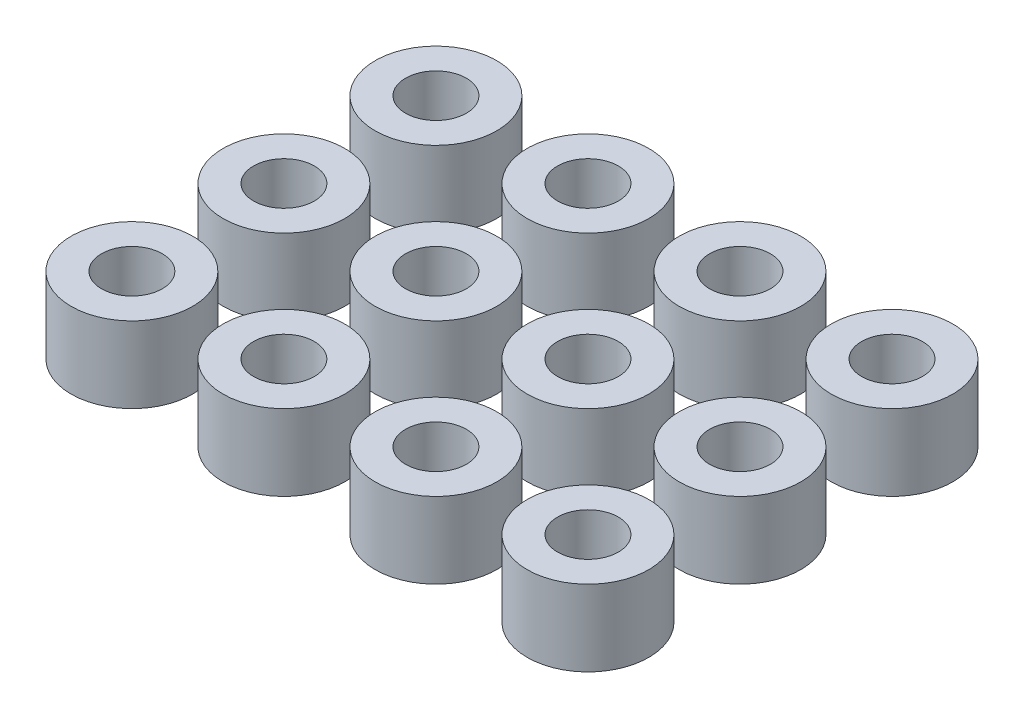
ISO-10303-21;
HEADER;
FILE_DESCRIPTION(('STEP AP214'),'2;1');
FILE_NAME('part.step','',(''),(''),'','','');
FILE_SCHEMA(('AUTOMOTIVE_DESIGN { 1 0 10303 214 1 1 1 1 }'));
ENDSEC;
DATA;
#1=APPLICATION_CONTEXT('core data for automotive mechanical design processes');
#2=APPLICATION_PROTOCOL_DEFINITION('international standard','automotive_design',2000,#1);
#3=PRODUCT_CONTEXT('',#1,'mechanical');
#4=PRODUCT('Part','Part','',(#3));
#5=PRODUCT_RELATED_PRODUCT_CATEGORY('part','',(#4));
#6=PRODUCT_DEFINITION_FORMATION('','',#4);
#7=PRODUCT_DEFINITION_CONTEXT('part definition',#1,'design');
#8=PRODUCT_DEFINITION('design','',#6,#7);
#9=PRODUCT_DEFINITION_SHAPE('','',#8);
#10=(LENGTH_UNIT() NAMED_UNIT(*) SI_UNIT(.MILLI.,.METRE.));
#11=(NAMED_UNIT(*) PLANE_ANGLE_UNIT() SI_UNIT($,.RADIAN.));
#12=(NAMED_UNIT(*) SI_UNIT($,.STERADIAN.) SOLID_ANGLE_UNIT());
#13=UNCERTAINTY_MEASURE_WITH_UNIT(LENGTH_MEASURE(1.E-05),#10,'distance_accuracy_value','');
#14=(GEOMETRIC_REPRESENTATION_CONTEXT(3) GLOBAL_UNCERTAINTY_ASSIGNED_CONTEXT((#13)) GLOBAL_UNIT_ASSIGNED_CONTEXT((#10,
#11,#12)) REPRESENTATION_CONTEXT('',''));
#15=CARTESIAN_POINT('',(0.,0.,0.));
#16=DIRECTION('',(0.,0.,1.));
#17=DIRECTION('',(1.,0.,0.));
#18=AXIS2_PLACEMENT_3D('',#15,#16,#17);
#19=CARTESIAN_POINT('',(-15.0000000000001,5.,-10.));
#20=DIRECTION('',(0.,1.,0.));
#21=DIRECTION('',(0.,0.,1.));
#22=AXIS2_PLACEMENT_3D('',#19,#20,#21);
#23=PLANE('',#22);
#24=CARTESIAN_POINT('',(-15.0000000000001,5.,-10.));
#25=DIRECTION('',(0.,1.,0.));
#26=DIRECTION('',(0.,0.,1.));
#27=AXIS2_PLACEMENT_3D('',#24,#25,#26);
#28=CIRCLE('',#27,4.);
#29=CARTESIAN_POINT('',(-15.0000000000001,5.,-6.00000000000001));
#30=VERTEX_POINT('',#29);
#31=EDGE_CURVE('E11',#30,#30,#28,.T.);
#32=ORIENTED_EDGE('',*,*,#31,.T.);
#33=EDGE_LOOP('',(#32));
#34=FACE_BOUND('',#33,.T.);
#35=CARTESIAN_POINT('',(-15.0000000000001,5.,-10.));
#36=DIRECTION('',(0.,1.,0.));
#37=DIRECTION('',(0.,0.,1.));
#38=AXIS2_PLACEMENT_3D('',#35,#36,#37);
#39=CIRCLE('',#38,2.00000000000001);
#40=CARTESIAN_POINT('',(-15.0000000000001,5.,-8.));
#41=VERTEX_POINT('',#40);
#42=EDGE_CURVE('E51',#41,#41,#39,.T.);
#43=ORIENTED_EDGE('',*,*,#42,.F.);
#44=EDGE_LOOP('',(#43));
#45=FACE_BOUND('',#44,.T.);
#46=ADVANCED_FACE('F40',(#34,#45),#23,.T.);
#47=CARTESIAN_POINT('',(-15.0000000000001,0.,-10.));
#48=DIRECTION('',(0.,1.,0.));
#49=DIRECTION('',(0.,0.,1.));
#50=AXIS2_PLACEMENT_3D('',#47,#48,#49);
#51=PLANE('',#50);
#52=CARTESIAN_POINT('',(-15.0000000000001,0.,-10.));
#53=DIRECTION('',(0.,1.,0.));
#54=DIRECTION('',(0.,0.,1.));
#55=AXIS2_PLACEMENT_3D('',#52,#53,#54);
#56=CIRCLE('',#55,4.);
#57=CARTESIAN_POINT('',(-15.0000000000001,0.,-6.00000000000001));
#58=VERTEX_POINT('',#57);
#59=EDGE_CURVE('E44',#58,#58,#56,.T.);
#60=ORIENTED_EDGE('',*,*,#59,.F.);
#61=EDGE_LOOP('',(#60));
#62=FACE_BOUND('',#61,.T.);
#63=CARTESIAN_POINT('',(-15.0000000000001,0.,-10.));
#64=DIRECTION('',(0.,1.,0.));
#65=DIRECTION('',(0.,0.,1.));
#66=AXIS2_PLACEMENT_3D('',#63,#64,#65);
#67=CIRCLE('',#66,2.00000000000001);
#68=CARTESIAN_POINT('',(-15.0000000000001,0.,-8.));
#69=VERTEX_POINT('',#68);
#70=EDGE_CURVE('E53',#69,#69,#67,.T.);
#71=ORIENTED_EDGE('',*,*,#70,.T.);
#72=EDGE_LOOP('',(#71));
#73=FACE_BOUND('',#72,.T.);
#74=ADVANCED_FACE('F63',(#62,#73),#51,.F.);
#75=CARTESIAN_POINT('',(-15.0000000000001,5.,-10.));
#76=DIRECTION('',(0.,-1.,0.));
#77=DIRECTION('',(0.,0.,-1.));
#78=AXIS2_PLACEMENT_3D('',#75,#76,#77);
#79=CYLINDRICAL_SURFACE('',#78,4.);
#80=ORIENTED_EDGE('',*,*,#31,.F.);
#81=EDGE_LOOP('',(#80));
#82=FACE_BOUND('',#81,.T.);
#83=ORIENTED_EDGE('',*,*,#59,.T.);
#84=EDGE_LOOP('',(#83));
#85=FACE_BOUND('',#84,.T.);
#86=ADVANCED_FACE('F42',(#82,#85),#79,.T.);
#87=CARTESIAN_POINT('',(-15.0000000000001,5.,-10.));
#88=DIRECTION('',(0.,-1.,0.));
#89=DIRECTION('',(0.,0.,-1.));
#90=AXIS2_PLACEMENT_3D('',#87,#88,#89);
#91=CYLINDRICAL_SURFACE('',#90,2.00000000000001);
#92=ORIENTED_EDGE('',*,*,#42,.T.);
#93=EDGE_LOOP('',(#92));
#94=FACE_BOUND('',#93,.T.);
#95=ORIENTED_EDGE('',*,*,#70,.F.);
#96=EDGE_LOOP('',(#95));
#97=FACE_BOUND('',#96,.T.);
#98=ADVANCED_FACE('F59',(#94,#97),#91,.F.);
#99=CLOSED_SHELL('',(#46,#74,#86,#98));
#100=MANIFOLD_SOLID_BREP('B2',#99);
#101=CARTESIAN_POINT('',(-15.,5.,0.));
#102=DIRECTION('',(0.,1.,0.));
#103=DIRECTION('',(0.,0.,1.));
#104=AXIS2_PLACEMENT_3D('',#101,#102,#103);
#105=PLANE('',#104);
#106=CARTESIAN_POINT('',(-15.,5.,0.));
#107=DIRECTION('',(0.,1.,0.));
#108=DIRECTION('',(0.,0.,1.));
#109=AXIS2_PLACEMENT_3D('',#106,#107,#108);
#110=CIRCLE('',#109,4.);
#111=CARTESIAN_POINT('',(-15.,5.,4.));
#112=VERTEX_POINT('',#111);
#113=EDGE_CURVE('E39',#112,#112,#110,.T.);
#114=ORIENTED_EDGE('',*,*,#113,.T.);
#115=EDGE_LOOP('',(#114));
#116=FACE_BOUND('',#115,.T.);
#117=CARTESIAN_POINT('',(-15.,5.,0.));
#118=DIRECTION('',(0.,1.,0.));
#119=DIRECTION('',(0.,0.,1.));
#120=AXIS2_PLACEMENT_3D('',#117,#118,#119);
#121=CIRCLE('',#120,2.00000000000001);
#122=CARTESIAN_POINT('',(-15.,5.,2.));
#123=VERTEX_POINT('',#122);
#124=EDGE_CURVE('E121',#123,#123,#121,.T.);
#125=ORIENTED_EDGE('',*,*,#124,.F.);
#126=EDGE_LOOP('',(#125));
#127=FACE_BOUND('',#126,.T.);
#128=ADVANCED_FACE('F110',(#116,#127),#105,.T.);
#129=CARTESIAN_POINT('',(-15.,0.,0.));
#130=DIRECTION('',(0.,1.,0.));
#131=DIRECTION('',(0.,0.,1.));
#132=AXIS2_PLACEMENT_3D('',#129,#130,#131);
#133=PLANE('',#132);
#134=CARTESIAN_POINT('',(-15.,0.,0.));
#135=DIRECTION('',(0.,1.,0.));
#136=DIRECTION('',(0.,0.,1.));
#137=AXIS2_PLACEMENT_3D('',#134,#135,#136);
#138=CIRCLE('',#137,4.);
#139=CARTESIAN_POINT('',(-15.,0.,4.));
#140=VERTEX_POINT('',#139);
#141=EDGE_CURVE('E114',#140,#140,#138,.T.);
#142=ORIENTED_EDGE('',*,*,#141,.F.);
#143=EDGE_LOOP('',(#142));
#144=FACE_BOUND('',#143,.T.);
#145=CARTESIAN_POINT('',(-15.,0.,0.));
#146=DIRECTION('',(0.,1.,0.));
#147=DIRECTION('',(0.,0.,1.));
#148=AXIS2_PLACEMENT_3D('',#145,#146,#147);
#149=CIRCLE('',#148,2.00000000000001);
#150=CARTESIAN_POINT('',(-15.,0.,2.));
#151=VERTEX_POINT('',#150);
#152=EDGE_CURVE('E123',#151,#151,#149,.T.);
#153=ORIENTED_EDGE('',*,*,#152,.T.);
#154=EDGE_LOOP('',(#153));
#155=FACE_BOUND('',#154,.T.);
#156=ADVANCED_FACE('F133',(#144,#155),#133,.F.);
#157=CARTESIAN_POINT('',(-15.,5.,0.));
#158=DIRECTION('',(0.,-1.,0.));
#159=DIRECTION('',(0.,0.,-1.));
#160=AXIS2_PLACEMENT_3D('',#157,#158,#159);
#161=CYLINDRICAL_SURFACE('',#160,4.);
#162=ORIENTED_EDGE('',*,*,#113,.F.);
#163=EDGE_LOOP('',(#162));
#164=FACE_BOUND('',#163,.T.);
#165=ORIENTED_EDGE('',*,*,#141,.T.);
#166=EDGE_LOOP('',(#165));
#167=FACE_BOUND('',#166,.T.);
#168=ADVANCED_FACE('F112',(#164,#167),#161,.T.);
#169=CARTESIAN_POINT('',(-15.,5.,0.));
#170=DIRECTION('',(0.,-1.,0.));
#171=DIRECTION('',(0.,0.,-1.));
#172=AXIS2_PLACEMENT_3D('',#169,#170,#171);
#173=CYLINDRICAL_SURFACE('',#172,2.00000000000001);
#174=ORIENTED_EDGE('',*,*,#124,.T.);
#175=EDGE_LOOP('',(#174));
#176=FACE_BOUND('',#175,.T.);
#177=ORIENTED_EDGE('',*,*,#152,.F.);
#178=EDGE_LOOP('',(#177));
#179=FACE_BOUND('',#178,.T.);
#180=ADVANCED_FACE('F129',(#176,#179),#173,.F.);
#181=CLOSED_SHELL('',(#128,#156,#168,#180));
#182=MANIFOLD_SOLID_BREP('B6',#181);
#183=CARTESIAN_POINT('',(14.9999999999999,5.,-10.));
#184=DIRECTION('',(0.,1.,0.));
#185=DIRECTION('',(0.,0.,1.));
#186=AXIS2_PLACEMENT_3D('',#183,#184,#185);
#187=PLANE('',#186);
#188=CARTESIAN_POINT('',(14.9999999999999,5.,-10.));
#189=DIRECTION('',(0.,1.,0.));
#190=DIRECTION('',(0.,0.,1.));
#191=AXIS2_PLACEMENT_3D('',#188,#189,#190);
#192=CIRCLE('',#191,4.);
#193=CARTESIAN_POINT('',(14.9999999999999,5.,-6.00000000000001));
#194=VERTEX_POINT('',#193);
#195=EDGE_CURVE('E109',#194,#194,#192,.T.);
#196=ORIENTED_EDGE('',*,*,#195,.T.);
#197=EDGE_LOOP('',(#196));
#198=FACE_BOUND('',#197,.T.);
#199=CARTESIAN_POINT('',(14.9999999999999,5.,-10.));
#200=DIRECTION('',(0.,1.,0.));
#201=DIRECTION('',(0.,0.,1.));
#202=AXIS2_PLACEMENT_3D('',#199,#200,#201);
#203=CIRCLE('',#202,2.00000000000001);
#204=CARTESIAN_POINT('',(14.9999999999999,5.,-8.));
#205=VERTEX_POINT('',#204);
#206=EDGE_CURVE('E191',#205,#205,#203,.T.);
#207=ORIENTED_EDGE('',*,*,#206,.F.);
#208=EDGE_LOOP('',(#207));
#209=FACE_BOUND('',#208,.T.);
#210=ADVANCED_FACE('F180',(#198,#209),#187,.T.);
#211=CARTESIAN_POINT('',(14.9999999999999,0.,-10.));
#212=DIRECTION('',(0.,1.,0.));
#213=DIRECTION('',(0.,0.,1.));
#214=AXIS2_PLACEMENT_3D('',#211,#212,#213);
#215=PLANE('',#214);
#216=CARTESIAN_POINT('',(14.9999999999999,0.,-10.));
#217=DIRECTION('',(0.,1.,0.));
#218=DIRECTION('',(0.,0.,1.));
#219=AXIS2_PLACEMENT_3D('',#216,#217,#218);
#220=CIRCLE('',#219,4.);
#221=CARTESIAN_POINT('',(14.9999999999999,0.,-6.00000000000001));
#222=VERTEX_POINT('',#221);
#223=EDGE_CURVE('E184',#222,#222,#220,.T.);
#224=ORIENTED_EDGE('',*,*,#223,.F.);
#225=EDGE_LOOP('',(#224));
#226=FACE_BOUND('',#225,.T.);
#227=CARTESIAN_POINT('',(14.9999999999999,0.,-10.));
#228=DIRECTION('',(0.,1.,0.));
#229=DIRECTION('',(0.,0.,1.));
#230=AXIS2_PLACEMENT_3D('',#227,#228,#229);
#231=CIRCLE('',#230,2.00000000000001);
#232=CARTESIAN_POINT('',(14.9999999999999,0.,-8.));
#233=VERTEX_POINT('',#232);
#234=EDGE_CURVE('E193',#233,#233,#231,.T.);
#235=ORIENTED_EDGE('',*,*,#234,.T.);
#236=EDGE_LOOP('',(#235));
#237=FACE_BOUND('',#236,.T.);
#238=ADVANCED_FACE('F203',(#226,#237),#215,.F.);
#239=CARTESIAN_POINT('',(14.9999999999999,5.,-10.));
#240=DIRECTION('',(0.,-1.,0.));
#241=DIRECTION('',(0.,0.,-1.));
#242=AXIS2_PLACEMENT_3D('',#239,#240,#241);
#243=CYLINDRICAL_SURFACE('',#242,4.);
#244=ORIENTED_EDGE('',*,*,#195,.F.);
#245=EDGE_LOOP('',(#244));
#246=FACE_BOUND('',#245,.T.);
#247=ORIENTED_EDGE('',*,*,#223,.T.);
#248=EDGE_LOOP('',(#247));
#249=FACE_BOUND('',#248,.T.);
#250=ADVANCED_FACE('F182',(#246,#249),#243,.T.);
#251=CARTESIAN_POINT('',(14.9999999999999,5.,-10.));
#252=DIRECTION('',(0.,-1.,0.));
#253=DIRECTION('',(0.,0.,-1.));
#254=AXIS2_PLACEMENT_3D('',#251,#252,#253);
#255=CYLINDRICAL_SURFACE('',#254,2.00000000000001);
#256=ORIENTED_EDGE('',*,*,#206,.T.);
#257=EDGE_LOOP('',(#256));
#258=FACE_BOUND('',#257,.T.);
#259=ORIENTED_EDGE('',*,*,#234,.F.);
#260=EDGE_LOOP('',(#259));
#261=FACE_BOUND('',#260,.T.);
#262=ADVANCED_FACE('F199',(#258,#261),#255,.F.);
#263=CLOSED_SHELL('',(#210,#238,#250,#262));
#264=MANIFOLD_SOLID_BREP('B34',#263);
#265=CARTESIAN_POINT('',(4.99999999999992,5.,-10.));
#266=DIRECTION('',(0.,1.,0.));
#267=DIRECTION('',(0.,0.,1.));
#268=AXIS2_PLACEMENT_3D('',#265,#266,#267);
#269=PLANE('',#268);
#270=CARTESIAN_POINT('',(4.99999999999992,5.,-10.));
#271=DIRECTION('',(0.,1.,0.));
#272=DIRECTION('',(0.,0.,1.));
#273=AXIS2_PLACEMENT_3D('',#270,#271,#272);
#274=CIRCLE('',#273,4.00000000000001);
#275=CARTESIAN_POINT('',(4.99999999999992,5.,-6.));
#276=VERTEX_POINT('',#275);
#277=EDGE_CURVE('E179',#276,#276,#274,.T.);
#278=ORIENTED_EDGE('',*,*,#277,.T.);
#279=EDGE_LOOP('',(#278));
#280=FACE_BOUND('',#279,.T.);
#281=CARTESIAN_POINT('',(4.99999999999992,5.,-10.));
#282=DIRECTION('',(0.,1.,0.));
#283=DIRECTION('',(0.,0.,1.));
#284=AXIS2_PLACEMENT_3D('',#281,#282,#283);
#285=CIRCLE('',#284,2.);
#286=CARTESIAN_POINT('',(4.99999999999992,5.,-8.00000000000001));
#287=VERTEX_POINT('',#286);
#288=EDGE_CURVE('E261',#287,#287,#285,.T.);
#289=ORIENTED_EDGE('',*,*,#288,.F.);
#290=EDGE_LOOP('',(#289));
#291=FACE_BOUND('',#290,.T.);
#292=ADVANCED_FACE('F250',(#280,#291),#269,.T.);
#293=CARTESIAN_POINT('',(4.99999999999992,0.,-10.));
#294=DIRECTION('',(0.,1.,0.));
#295=DIRECTION('',(0.,0.,1.));
#296=AXIS2_PLACEMENT_3D('',#293,#294,#295);
#297=PLANE('',#296);
#298=CARTESIAN_POINT('',(4.99999999999992,0.,-10.));
#299=DIRECTION('',(0.,1.,0.));
#300=DIRECTION('',(0.,0.,1.));
#301=AXIS2_PLACEMENT_3D('',#298,#299,#300);
#302=CIRCLE('',#301,4.00000000000001);
#303=CARTESIAN_POINT('',(4.99999999999992,0.,-6.));
#304=VERTEX_POINT('',#303);
#305=EDGE_CURVE('E254',#304,#304,#302,.T.);
#306=ORIENTED_EDGE('',*,*,#305,.F.);
#307=EDGE_LOOP('',(#306));
#308=FACE_BOUND('',#307,.T.);
#309=CARTESIAN_POINT('',(4.99999999999992,0.,-10.));
#310=DIRECTION('',(0.,1.,0.));
#311=DIRECTION('',(0.,0.,1.));
#312=AXIS2_PLACEMENT_3D('',#309,#310,#311);
#313=CIRCLE('',#312,2.);
#314=CARTESIAN_POINT('',(4.99999999999992,0.,-8.00000000000001));
#315=VERTEX_POINT('',#314);
#316=EDGE_CURVE('E263',#315,#315,#313,.T.);
#317=ORIENTED_EDGE('',*,*,#316,.T.);
#318=EDGE_LOOP('',(#317));
#319=FACE_BOUND('',#318,.T.);
#320=ADVANCED_FACE('F273',(#308,#319),#297,.F.);
#321=CARTESIAN_POINT('',(4.99999999999992,5.,-10.));
#322=DIRECTION('',(0.,-1.,0.));
#323=DIRECTION('',(0.,0.,-1.));
#324=AXIS2_PLACEMENT_3D('',#321,#322,#323);
#325=CYLINDRICAL_SURFACE('',#324,4.00000000000001);
#326=ORIENTED_EDGE('',*,*,#277,.F.);
#327=EDGE_LOOP('',(#326));
#328=FACE_BOUND('',#327,.T.);
#329=ORIENTED_EDGE('',*,*,#305,.T.);
#330=EDGE_LOOP('',(#329));
#331=FACE_BOUND('',#330,.T.);
#332=ADVANCED_FACE('F252',(#328,#331),#325,.T.);
#333=CARTESIAN_POINT('',(4.99999999999992,5.,-10.));
#334=DIRECTION('',(0.,-1.,0.));
#335=DIRECTION('',(0.,0.,-1.));
#336=AXIS2_PLACEMENT_3D('',#333,#334,#335);
#337=CYLINDRICAL_SURFACE('',#336,2.);
#338=ORIENTED_EDGE('',*,*,#288,.T.);
#339=EDGE_LOOP('',(#338));
#340=FACE_BOUND('',#339,.T.);
#341=ORIENTED_EDGE('',*,*,#316,.F.);
#342=EDGE_LOOP('',(#341));
#343=FACE_BOUND('',#342,.T.);
#344=ADVANCED_FACE('F269',(#340,#343),#337,.F.);
#345=CLOSED_SHELL('',(#292,#320,#332,#344));
#346=MANIFOLD_SOLID_BREP('B104',#345);
#347=CARTESIAN_POINT('',(-5.00000000000007,5.,-10.));
#348=DIRECTION('',(0.,1.,0.));
#349=DIRECTION('',(0.,0.,1.));
#350=AXIS2_PLACEMENT_3D('',#347,#348,#349);
#351=PLANE('',#350);
#352=CARTESIAN_POINT('',(-5.00000000000007,5.,-10.));
#353=DIRECTION('',(0.,1.,0.));
#354=DIRECTION('',(0.,0.,1.));
#355=AXIS2_PLACEMENT_3D('',#352,#353,#354);
#356=CIRCLE('',#355,4.00000000000001);
#357=CARTESIAN_POINT('',(-5.00000000000007,5.,-6.));
#358=VERTEX_POINT('',#357);
#359=EDGE_CURVE('E249',#358,#358,#356,.T.);
#360=ORIENTED_EDGE('',*,*,#359,.T.);
#361=EDGE_LOOP('',(#360));
#362=FACE_BOUND('',#361,.T.);
#363=CARTESIAN_POINT('',(-5.00000000000007,5.,-10.));
#364=DIRECTION('',(0.,1.,0.));
#365=DIRECTION('',(0.,0.,1.));
#366=AXIS2_PLACEMENT_3D('',#363,#364,#365);
#367=CIRCLE('',#366,2.);
#368=CARTESIAN_POINT('',(-5.00000000000007,5.,-8.00000000000001));
#369=VERTEX_POINT('',#368);
#370=EDGE_CURVE('E331',#369,#369,#367,.T.);
#371=ORIENTED_EDGE('',*,*,#370,.F.);
#372=EDGE_LOOP('',(#371));
#373=FACE_BOUND('',#372,.T.);
#374=ADVANCED_FACE('F320',(#362,#373),#351,.T.);
#375=CARTESIAN_POINT('',(-5.00000000000007,0.,-10.));
#376=DIRECTION('',(0.,1.,0.));
#377=DIRECTION('',(0.,0.,1.));
#378=AXIS2_PLACEMENT_3D('',#375,#376,#377);
#379=PLANE('',#378);
#380=CARTESIAN_POINT('',(-5.00000000000007,0.,-10.));
#381=DIRECTION('',(0.,1.,0.));
#382=DIRECTION('',(0.,0.,1.));
#383=AXIS2_PLACEMENT_3D('',#380,#381,#382);
#384=CIRCLE('',#383,4.00000000000001);
#385=CARTESIAN_POINT('',(-5.00000000000007,0.,-6.));
#386=VERTEX_POINT('',#385);
#387=EDGE_CURVE('E324',#386,#386,#384,.T.);
#388=ORIENTED_EDGE('',*,*,#387,.F.);
#389=EDGE_LOOP('',(#388));
#390=FACE_BOUND('',#389,.T.);
#391=CARTESIAN_POINT('',(-5.00000000000007,0.,-10.));
#392=DIRECTION('',(0.,1.,0.));
#393=DIRECTION('',(0.,0.,1.));
#394=AXIS2_PLACEMENT_3D('',#391,#392,#393);
#395=CIRCLE('',#394,2.);
#396=CARTESIAN_POINT('',(-5.00000000000007,0.,-8.00000000000001));
#397=VERTEX_POINT('',#396);
#398=EDGE_CURVE('E333',#397,#397,#395,.T.);
#399=ORIENTED_EDGE('',*,*,#398,.T.);
#400=EDGE_LOOP('',(#399));
#401=FACE_BOUND('',#400,.T.);
#402=ADVANCED_FACE('F343',(#390,#401),#379,.F.);
#403=CARTESIAN_POINT('',(-5.00000000000007,5.,-10.));
#404=DIRECTION('',(0.,-1.,0.));
#405=DIRECTION('',(0.,0.,-1.));
#406=AXIS2_PLACEMENT_3D('',#403,#404,#405);
#407=CYLINDRICAL_SURFACE('',#406,4.00000000000001);
#408=ORIENTED_EDGE('',*,*,#359,.F.);
#409=EDGE_LOOP('',(#408));
#410=FACE_BOUND('',#409,.T.);
#411=ORIENTED_EDGE('',*,*,#387,.T.);
#412=EDGE_LOOP('',(#411));
#413=FACE_BOUND('',#412,.T.);
#414=ADVANCED_FACE('F322',(#410,#413),#407,.T.);
#415=CARTESIAN_POINT('',(-5.00000000000007,5.,-10.));
#416=DIRECTION('',(0.,-1.,0.));
#417=DIRECTION('',(0.,0.,-1.));
#418=AXIS2_PLACEMENT_3D('',#415,#416,#417);
#419=CYLINDRICAL_SURFACE('',#418,2.);
#420=ORIENTED_EDGE('',*,*,#370,.T.);
#421=EDGE_LOOP('',(#420));
#422=FACE_BOUND('',#421,.T.);
#423=ORIENTED_EDGE('',*,*,#398,.F.);
#424=EDGE_LOOP('',(#423));
#425=FACE_BOUND('',#424,.T.);
#426=ADVANCED_FACE('F339',(#422,#425),#419,.F.);
#427=CLOSED_SHELL('',(#374,#402,#414,#426));
#428=MANIFOLD_SOLID_BREP('B174',#427);
#429=CARTESIAN_POINT('',(15.,5.,0.));
#430=DIRECTION('',(0.,1.,0.));
#431=DIRECTION('',(0.,0.,1.));
#432=AXIS2_PLACEMENT_3D('',#429,#430,#431);
#433=PLANE('',#432);
#434=CARTESIAN_POINT('',(15.,5.,0.));
#435=DIRECTION('',(0.,1.,0.));
#436=DIRECTION('',(0.,0.,1.));
#437=AXIS2_PLACEMENT_3D('',#434,#435,#436);
#438=CIRCLE('',#437,4.);
#439=CARTESIAN_POINT('',(15.,5.,4.));
#440=VERTEX_POINT('',#439);
#441=EDGE_CURVE('E319',#440,#440,#438,.T.);
#442=ORIENTED_EDGE('',*,*,#441,.T.);
#443=EDGE_LOOP('',(#442));
#444=FACE_BOUND('',#443,.T.);
#445=CARTESIAN_POINT('',(15.,5.,0.));
#446=DIRECTION('',(0.,1.,0.));
#447=DIRECTION('',(0.,0.,1.));
#448=AXIS2_PLACEMENT_3D('',#445,#446,#447);
#449=CIRCLE('',#448,2.);
#450=CARTESIAN_POINT('',(15.,5.,2.));
#451=VERTEX_POINT('',#450);
#452=EDGE_CURVE('E401',#451,#451,#449,.T.);
#453=ORIENTED_EDGE('',*,*,#452,.F.);
#454=EDGE_LOOP('',(#453));
#455=FACE_BOUND('',#454,.T.);
#456=ADVANCED_FACE('F390',(#444,#455),#433,.T.);
#457=CARTESIAN_POINT('',(15.,0.,0.));
#458=DIRECTION('',(0.,1.,0.));
#459=DIRECTION('',(0.,0.,1.));
#460=AXIS2_PLACEMENT_3D('',#457,#458,#459);
#461=PLANE('',#460);
#462=CARTESIAN_POINT('',(15.,0.,0.));
#463=DIRECTION('',(0.,1.,0.));
#464=DIRECTION('',(0.,0.,1.));
#465=AXIS2_PLACEMENT_3D('',#462,#463,#464);
#466=CIRCLE('',#465,4.);
#467=CARTESIAN_POINT('',(15.,0.,4.));
#468=VERTEX_POINT('',#467);
#469=EDGE_CURVE('E394',#468,#468,#466,.T.);
#470=ORIENTED_EDGE('',*,*,#469,.F.);
#471=EDGE_LOOP('',(#470));
#472=FACE_BOUND('',#471,.T.);
#473=CARTESIAN_POINT('',(15.,0.,0.));
#474=DIRECTION('',(0.,1.,0.));
#475=DIRECTION('',(0.,0.,1.));
#476=AXIS2_PLACEMENT_3D('',#473,#474,#475);
#477=CIRCLE('',#476,2.);
#478=CARTESIAN_POINT('',(15.,0.,2.));
#479=VERTEX_POINT('',#478);
#480=EDGE_CURVE('E403',#479,#479,#477,.T.);
#481=ORIENTED_EDGE('',*,*,#480,.T.);
#482=EDGE_LOOP('',(#481));
#483=FACE_BOUND('',#482,.T.);
#484=ADVANCED_FACE('F413',(#472,#483),#461,.F.);
#485=CARTESIAN_POINT('',(15.,5.,0.));
#486=DIRECTION('',(0.,-1.,0.));
#487=DIRECTION('',(0.,0.,-1.));
#488=AXIS2_PLACEMENT_3D('',#485,#486,#487);
#489=CYLINDRICAL_SURFACE('',#488,4.);
#490=ORIENTED_EDGE('',*,*,#441,.F.);
#491=EDGE_LOOP('',(#490));
#492=FACE_BOUND('',#491,.T.);
#493=ORIENTED_EDGE('',*,*,#469,.T.);
#494=EDGE_LOOP('',(#493));
#495=FACE_BOUND('',#494,.T.);
#496=ADVANCED_FACE('F392',(#492,#495),#489,.T.);
#497=CARTESIAN_POINT('',(15.,5.,0.));
#498=DIRECTION('',(0.,-1.,0.));
#499=DIRECTION('',(0.,0.,-1.));
#500=AXIS2_PLACEMENT_3D('',#497,#498,#499);
#501=CYLINDRICAL_SURFACE('',#500,2.);
#502=ORIENTED_EDGE('',*,*,#452,.T.);
#503=EDGE_LOOP('',(#502));
#504=FACE_BOUND('',#503,.T.);
#505=ORIENTED_EDGE('',*,*,#480,.F.);
#506=EDGE_LOOP('',(#505));
#507=FACE_BOUND('',#506,.T.);
#508=ADVANCED_FACE('F409',(#504,#507),#501,.F.);
#509=CLOSED_SHELL('',(#456,#484,#496,#508));
#510=MANIFOLD_SOLID_BREP('B244',#509);
#511=CARTESIAN_POINT('',(4.99999999999996,5.,0.));
#512=DIRECTION('',(0.,1.,0.));
#513=DIRECTION('',(0.,0.,1.));
#514=AXIS2_PLACEMENT_3D('',#511,#512,#513);
#515=PLANE('',#514);
#516=CARTESIAN_POINT('',(4.99999999999996,5.,0.));
#517=DIRECTION('',(0.,1.,0.));
#518=DIRECTION('',(0.,0.,1.));
#519=AXIS2_PLACEMENT_3D('',#516,#517,#518);
#520=CIRCLE('',#519,4.00000000000001);
#521=CARTESIAN_POINT('',(4.99999999999996,5.,4.));
#522=VERTEX_POINT('',#521);
#523=EDGE_CURVE('E389',#522,#522,#520,.T.);
#524=ORIENTED_EDGE('',*,*,#523,.T.);
#525=EDGE_LOOP('',(#524));
#526=FACE_BOUND('',#525,.T.);
#527=CARTESIAN_POINT('',(4.99999999999996,5.,0.));
#528=DIRECTION('',(0.,1.,0.));
#529=DIRECTION('',(0.,0.,1.));
#530=AXIS2_PLACEMENT_3D('',#527,#528,#529);
#531=CIRCLE('',#530,2.00000000000001);
#532=CARTESIAN_POINT('',(4.99999999999996,5.,2.));
#533=VERTEX_POINT('',#532);
#534=EDGE_CURVE('E471',#533,#533,#531,.T.);
#535=ORIENTED_EDGE('',*,*,#534,.F.);
#536=EDGE_LOOP('',(#535));
#537=FACE_BOUND('',#536,.T.);
#538=ADVANCED_FACE('F460',(#526,#537),#515,.T.);
#539=CARTESIAN_POINT('',(4.99999999999996,0.,0.));
#540=DIRECTION('',(0.,1.,0.));
#541=DIRECTION('',(0.,0.,1.));
#542=AXIS2_PLACEMENT_3D('',#539,#540,#541);
#543=PLANE('',#542);
#544=CARTESIAN_POINT('',(4.99999999999996,0.,0.));
#545=DIRECTION('',(0.,1.,0.));
#546=DIRECTION('',(0.,0.,1.));
#547=AXIS2_PLACEMENT_3D('',#544,#545,#546);
#548=CIRCLE('',#547,4.00000000000001);
#549=CARTESIAN_POINT('',(4.99999999999996,0.,4.));
#550=VERTEX_POINT('',#549);
#551=EDGE_CURVE('E464',#550,#550,#548,.T.);
#552=ORIENTED_EDGE('',*,*,#551,.F.);
#553=EDGE_LOOP('',(#552));
#554=FACE_BOUND('',#553,.T.);
#555=CARTESIAN_POINT('',(4.99999999999996,0.,0.));
#556=DIRECTION('',(0.,1.,0.));
#557=DIRECTION('',(0.,0.,1.));
#558=AXIS2_PLACEMENT_3D('',#555,#556,#557);
#559=CIRCLE('',#558,2.00000000000001);
#560=CARTESIAN_POINT('',(4.99999999999996,0.,2.));
#561=VERTEX_POINT('',#560);
#562=EDGE_CURVE('E473',#561,#561,#559,.T.);
#563=ORIENTED_EDGE('',*,*,#562,.T.);
#564=EDGE_LOOP('',(#563));
#565=FACE_BOUND('',#564,.T.);
#566=ADVANCED_FACE('F483',(#554,#565),#543,.F.);
#567=CARTESIAN_POINT('',(4.99999999999996,5.,0.));
#568=DIRECTION('',(0.,-1.,0.));
#569=DIRECTION('',(0.,0.,-1.));
#570=AXIS2_PLACEMENT_3D('',#567,#568,#569);
#571=CYLINDRICAL_SURFACE('',#570,4.00000000000001);
#572=ORIENTED_EDGE('',*,*,#523,.F.);
#573=EDGE_LOOP('',(#572));
#574=FACE_BOUND('',#573,.T.);
#575=ORIENTED_EDGE('',*,*,#551,.T.);
#576=EDGE_LOOP('',(#575));
#577=FACE_BOUND('',#576,.T.);
#578=ADVANCED_FACE('F462',(#574,#577),#571,.T.);
#579=CARTESIAN_POINT('',(4.99999999999996,5.,0.));
#580=DIRECTION('',(0.,-1.,0.));
#581=DIRECTION('',(0.,0.,-1.));
#582=AXIS2_PLACEMENT_3D('',#579,#580,#581);
#583=CYLINDRICAL_SURFACE('',#582,2.00000000000001);
#584=ORIENTED_EDGE('',*,*,#534,.T.);
#585=EDGE_LOOP('',(#584));
#586=FACE_BOUND('',#585,.T.);
#587=ORIENTED_EDGE('',*,*,#562,.F.);
#588=EDGE_LOOP('',(#587));
#589=FACE_BOUND('',#588,.T.);
#590=ADVANCED_FACE('F479',(#586,#589),#583,.F.);
#591=CLOSED_SHELL('',(#538,#566,#578,#590));
#592=MANIFOLD_SOLID_BREP('B314',#591);
#593=CARTESIAN_POINT('',(-5.00000000000004,5.,0.));
#594=DIRECTION('',(0.,1.,0.));
#595=DIRECTION('',(0.,0.,1.));
#596=AXIS2_PLACEMENT_3D('',#593,#594,#595);
#597=PLANE('',#596);
#598=CARTESIAN_POINT('',(-5.00000000000004,5.,0.));
#599=DIRECTION('',(0.,1.,0.));
#600=DIRECTION('',(0.,0.,1.));
#601=AXIS2_PLACEMENT_3D('',#598,#599,#600);
#602=CIRCLE('',#601,4.00000000000001);
#603=CARTESIAN_POINT('',(-5.00000000000004,5.,4.));
#604=VERTEX_POINT('',#603);
#605=EDGE_CURVE('E459',#604,#604,#602,.T.);
#606=ORIENTED_EDGE('',*,*,#605,.T.);
#607=EDGE_LOOP('',(#606));
#608=FACE_BOUND('',#607,.T.);
#609=CARTESIAN_POINT('',(-5.00000000000004,5.,0.));
#610=DIRECTION('',(0.,1.,0.));
#611=DIRECTION('',(0.,0.,1.));
#612=AXIS2_PLACEMENT_3D('',#609,#610,#611);
#613=CIRCLE('',#612,2.);
#614=CARTESIAN_POINT('',(-5.00000000000004,5.,2.));
#615=VERTEX_POINT('',#614);
#616=EDGE_CURVE('E541',#615,#615,#613,.T.);
#617=ORIENTED_EDGE('',*,*,#616,.F.);
#618=EDGE_LOOP('',(#617));
#619=FACE_BOUND('',#618,.T.);
#620=ADVANCED_FACE('F530',(#608,#619),#597,.T.);
#621=CARTESIAN_POINT('',(-5.00000000000004,0.,0.));
#622=DIRECTION('',(0.,1.,0.));
#623=DIRECTION('',(0.,0.,1.));
#624=AXIS2_PLACEMENT_3D('',#621,#622,#623);
#625=PLANE('',#624);
#626=CARTESIAN_POINT('',(-5.00000000000004,0.,0.));
#627=DIRECTION('',(0.,1.,0.));
#628=DIRECTION('',(0.,0.,1.));
#629=AXIS2_PLACEMENT_3D('',#626,#627,#628);
#630=CIRCLE('',#629,4.00000000000001);
#631=CARTESIAN_POINT('',(-5.00000000000004,0.,4.));
#632=VERTEX_POINT('',#631);
#633=EDGE_CURVE('E534',#632,#632,#630,.T.);
#634=ORIENTED_EDGE('',*,*,#633,.F.);
#635=EDGE_LOOP('',(#634));
#636=FACE_BOUND('',#635,.T.);
#637=CARTESIAN_POINT('',(-5.00000000000004,0.,0.));
#638=DIRECTION('',(0.,1.,0.));
#639=DIRECTION('',(0.,0.,1.));
#640=AXIS2_PLACEMENT_3D('',#637,#638,#639);
#641=CIRCLE('',#640,2.);
#642=CARTESIAN_POINT('',(-5.00000000000004,0.,2.));
#643=VERTEX_POINT('',#642);
#644=EDGE_CURVE('E543',#643,#643,#641,.T.);
#645=ORIENTED_EDGE('',*,*,#644,.T.);
#646=EDGE_LOOP('',(#645));
#647=FACE_BOUND('',#646,.T.);
#648=ADVANCED_FACE('F553',(#636,#647),#625,.F.);
#649=CARTESIAN_POINT('',(-5.00000000000004,5.,0.));
#650=DIRECTION('',(0.,-1.,0.));
#651=DIRECTION('',(0.,0.,-1.));
#652=AXIS2_PLACEMENT_3D('',#649,#650,#651);
#653=CYLINDRICAL_SURFACE('',#652,4.00000000000001);
#654=ORIENTED_EDGE('',*,*,#605,.F.);
#655=EDGE_LOOP('',(#654));
#656=FACE_BOUND('',#655,.T.);
#657=ORIENTED_EDGE('',*,*,#633,.T.);
#658=EDGE_LOOP('',(#657));
#659=FACE_BOUND('',#658,.T.);
#660=ADVANCED_FACE('F532',(#656,#659),#653,.T.);
#661=CARTESIAN_POINT('',(-5.00000000000004,5.,0.));
#662=DIRECTION('',(0.,-1.,0.));
#663=DIRECTION('',(0.,0.,-1.));
#664=AXIS2_PLACEMENT_3D('',#661,#662,#663);
#665=CYLINDRICAL_SURFACE('',#664,2.);
#666=ORIENTED_EDGE('',*,*,#616,.T.);
#667=EDGE_LOOP('',(#666));
#668=FACE_BOUND('',#667,.T.);
#669=ORIENTED_EDGE('',*,*,#644,.F.);
#670=EDGE_LOOP('',(#669));
#671=FACE_BOUND('',#670,.T.);
#672=ADVANCED_FACE('F549',(#668,#671),#665,.F.);
#673=CLOSED_SHELL('',(#620,#648,#660,#672));
#674=MANIFOLD_SOLID_BREP('B384',#673);
#675=CARTESIAN_POINT('',(15.,5.,9.99999999999999));
#676=DIRECTION('',(0.,1.,0.));
#677=DIRECTION('',(0.,0.,1.));
#678=AXIS2_PLACEMENT_3D('',#675,#676,#677);
#679=PLANE('',#678);
#680=CARTESIAN_POINT('',(15.,5.,9.99999999999999));
#681=DIRECTION('',(0.,1.,0.));
#682=DIRECTION('',(0.,0.,1.));
#683=AXIS2_PLACEMENT_3D('',#680,#681,#682);
#684=CIRCLE('',#683,4.00000000000001);
#685=CARTESIAN_POINT('',(15.,5.,14.));
#686=VERTEX_POINT('',#685);
#687=EDGE_CURVE('E529',#686,#686,#684,.T.);
#688=ORIENTED_EDGE('',*,*,#687,.T.);
#689=EDGE_LOOP('',(#688));
#690=FACE_BOUND('',#689,.T.);
#691=CARTESIAN_POINT('',(15.,5.,9.99999999999999));
#692=DIRECTION('',(0.,1.,0.));
#693=DIRECTION('',(0.,0.,1.));
#694=AXIS2_PLACEMENT_3D('',#691,#692,#693);
#695=CIRCLE('',#694,2.00000000000001);
#696=CARTESIAN_POINT('',(15.,5.,12.));
#697=VERTEX_POINT('',#696);
#698=EDGE_CURVE('E611',#697,#697,#695,.T.);
#699=ORIENTED_EDGE('',*,*,#698,.F.);
#700=EDGE_LOOP('',(#699));
#701=FACE_BOUND('',#700,.T.);
#702=ADVANCED_FACE('F600',(#690,#701),#679,.T.);
#703=CARTESIAN_POINT('',(15.,0.,9.99999999999999));
#704=DIRECTION('',(0.,1.,0.));
#705=DIRECTION('',(0.,0.,1.));
#706=AXIS2_PLACEMENT_3D('',#703,#704,#705);
#707=PLANE('',#706);
#708=CARTESIAN_POINT('',(15.,0.,9.99999999999999));
#709=DIRECTION('',(0.,1.,0.));
#710=DIRECTION('',(0.,0.,1.));
#711=AXIS2_PLACEMENT_3D('',#708,#709,#710);
#712=CIRCLE('',#711,4.00000000000001);
#713=CARTESIAN_POINT('',(15.,0.,14.));
#714=VERTEX_POINT('',#713);
#715=EDGE_CURVE('E604',#714,#714,#712,.T.);
#716=ORIENTED_EDGE('',*,*,#715,.F.);
#717=EDGE_LOOP('',(#716));
#718=FACE_BOUND('',#717,.T.);
#719=CARTESIAN_POINT('',(15.,0.,9.99999999999999));
#720=DIRECTION('',(0.,1.,0.));
#721=DIRECTION('',(0.,0.,1.));
#722=AXIS2_PLACEMENT_3D('',#719,#720,#721);
#723=CIRCLE('',#722,2.00000000000001);
#724=CARTESIAN_POINT('',(15.,0.,12.));
#725=VERTEX_POINT('',#724);
#726=EDGE_CURVE('E613',#725,#725,#723,.T.);
#727=ORIENTED_EDGE('',*,*,#726,.T.);
#728=EDGE_LOOP('',(#727));
#729=FACE_BOUND('',#728,.T.);
#730=ADVANCED_FACE('F623',(#718,#729),#707,.F.);
#731=CARTESIAN_POINT('',(15.,5.,9.99999999999999));
#732=DIRECTION('',(0.,-1.,0.));
#733=DIRECTION('',(0.,0.,-1.));
#734=AXIS2_PLACEMENT_3D('',#731,#732,#733);
#735=CYLINDRICAL_SURFACE('',#734,4.00000000000001);
#736=ORIENTED_EDGE('',*,*,#687,.F.);
#737=EDGE_LOOP('',(#736));
#738=FACE_BOUND('',#737,.T.);
#739=ORIENTED_EDGE('',*,*,#715,.T.);
#740=EDGE_LOOP('',(#739));
#741=FACE_BOUND('',#740,.T.);
#742=ADVANCED_FACE('F602',(#738,#741),#735,.T.);
#743=CARTESIAN_POINT('',(15.,5.,9.99999999999999));
#744=DIRECTION('',(0.,-1.,0.));
#745=DIRECTION('',(0.,0.,-1.));
#746=AXIS2_PLACEMENT_3D('',#743,#744,#745);
#747=CYLINDRICAL_SURFACE('',#746,2.00000000000001);
#748=ORIENTED_EDGE('',*,*,#698,.T.);
#749=EDGE_LOOP('',(#748));
#750=FACE_BOUND('',#749,.T.);
#751=ORIENTED_EDGE('',*,*,#726,.F.);
#752=EDGE_LOOP('',(#751));
#753=FACE_BOUND('',#752,.T.);
#754=ADVANCED_FACE('F619',(#750,#753),#747,.F.);
#755=CLOSED_SHELL('',(#702,#730,#742,#754));
#756=MANIFOLD_SOLID_BREP('B454',#755);
#757=CARTESIAN_POINT('',(4.99999999999999,5.,9.99999999999999));
#758=DIRECTION('',(0.,1.,0.));
#759=DIRECTION('',(0.,0.,1.));
#760=AXIS2_PLACEMENT_3D('',#757,#758,#759);
#761=PLANE('',#760);
#762=CARTESIAN_POINT('',(4.99999999999999,5.,9.99999999999999));
#763=DIRECTION('',(0.,1.,0.));
#764=DIRECTION('',(0.,0.,1.));
#765=AXIS2_PLACEMENT_3D('',#762,#763,#764);
#766=CIRCLE('',#765,4.00000000000001);
#767=CARTESIAN_POINT('',(4.99999999999999,5.,14.));
#768=VERTEX_POINT('',#767);
#769=EDGE_CURVE('E599',#768,#768,#766,.T.);
#770=ORIENTED_EDGE('',*,*,#769,.T.);
#771=EDGE_LOOP('',(#770));
#772=FACE_BOUND('',#771,.T.);
#773=CARTESIAN_POINT('',(4.99999999999999,5.,9.99999999999999));
#774=DIRECTION('',(0.,1.,0.));
#775=DIRECTION('',(0.,0.,1.));
#776=AXIS2_PLACEMENT_3D('',#773,#774,#775);
#777=CIRCLE('',#776,2.);
#778=CARTESIAN_POINT('',(4.99999999999999,5.,12.));
#779=VERTEX_POINT('',#778);
#780=EDGE_CURVE('E681',#779,#779,#777,.T.);
#781=ORIENTED_EDGE('',*,*,#780,.F.);
#782=EDGE_LOOP('',(#781));
#783=FACE_BOUND('',#782,.T.);
#784=ADVANCED_FACE('F670',(#772,#783),#761,.T.);
#785=CARTESIAN_POINT('',(4.99999999999999,0.,9.99999999999999));
#786=DIRECTION('',(0.,1.,0.));
#787=DIRECTION('',(0.,0.,1.));
#788=AXIS2_PLACEMENT_3D('',#785,#786,#787);
#789=PLANE('',#788);
#790=CARTESIAN_POINT('',(4.99999999999999,0.,9.99999999999999));
#791=DIRECTION('',(0.,1.,0.));
#792=DIRECTION('',(0.,0.,1.));
#793=AXIS2_PLACEMENT_3D('',#790,#791,#792);
#794=CIRCLE('',#793,4.00000000000001);
#795=CARTESIAN_POINT('',(4.99999999999999,0.,14.));
#796=VERTEX_POINT('',#795);
#797=EDGE_CURVE('E674',#796,#796,#794,.T.);
#798=ORIENTED_EDGE('',*,*,#797,.F.);
#799=EDGE_LOOP('',(#798));
#800=FACE_BOUND('',#799,.T.);
#801=CARTESIAN_POINT('',(4.99999999999999,0.,9.99999999999999));
#802=DIRECTION('',(0.,1.,0.));
#803=DIRECTION('',(0.,0.,1.));
#804=AXIS2_PLACEMENT_3D('',#801,#802,#803);
#805=CIRCLE('',#804,2.);
#806=CARTESIAN_POINT('',(4.99999999999999,0.,12.));
#807=VERTEX_POINT('',#806);
#808=EDGE_CURVE('E683',#807,#807,#805,.T.);
#809=ORIENTED_EDGE('',*,*,#808,.T.);
#810=EDGE_LOOP('',(#809));
#811=FACE_BOUND('',#810,.T.);
#812=ADVANCED_FACE('F693',(#800,#811),#789,.F.);
#813=CARTESIAN_POINT('',(4.99999999999999,5.,9.99999999999999));
#814=DIRECTION('',(0.,-1.,0.));
#815=DIRECTION('',(0.,0.,-1.));
#816=AXIS2_PLACEMENT_3D('',#813,#814,#815);
#817=CYLINDRICAL_SURFACE('',#816,4.00000000000001);
#818=ORIENTED_EDGE('',*,*,#769,.F.);
#819=EDGE_LOOP('',(#818));
#820=FACE_BOUND('',#819,.T.);
#821=ORIENTED_EDGE('',*,*,#797,.T.);
#822=EDGE_LOOP('',(#821));
#823=FACE_BOUND('',#822,.T.);
#824=ADVANCED_FACE('F672',(#820,#823),#817,.T.);
#825=CARTESIAN_POINT('',(4.99999999999999,5.,9.99999999999999));
#826=DIRECTION('',(0.,-1.,0.));
#827=DIRECTION('',(0.,0.,-1.));
#828=AXIS2_PLACEMENT_3D('',#825,#826,#827);
#829=CYLINDRICAL_SURFACE('',#828,2.);
#830=ORIENTED_EDGE('',*,*,#780,.T.);
#831=EDGE_LOOP('',(#830));
#832=FACE_BOUND('',#831,.T.);
#833=ORIENTED_EDGE('',*,*,#808,.F.);
#834=EDGE_LOOP('',(#833));
#835=FACE_BOUND('',#834,.T.);
#836=ADVANCED_FACE('F689',(#832,#835),#829,.F.);
#837=CLOSED_SHELL('',(#784,#812,#824,#836));
#838=MANIFOLD_SOLID_BREP('B524',#837);
#839=CARTESIAN_POINT('',(-5.,5.,9.99999999999999));
#840=DIRECTION('',(0.,1.,0.));
#841=DIRECTION('',(0.,0.,1.));
#842=AXIS2_PLACEMENT_3D('',#839,#840,#841);
#843=PLANE('',#842);
#844=CARTESIAN_POINT('',(-5.,5.,9.99999999999999));
#845=DIRECTION('',(0.,1.,0.));
#846=DIRECTION('',(0.,0.,1.));
#847=AXIS2_PLACEMENT_3D('',#844,#845,#846);
#848=CIRCLE('',#847,4.00000000000001);
#849=CARTESIAN_POINT('',(-5.,5.,14.));
#850=VERTEX_POINT('',#849);
#851=EDGE_CURVE('E669',#850,#850,#848,.T.);
#852=ORIENTED_EDGE('',*,*,#851,.T.);
#853=EDGE_LOOP('',(#852));
#854=FACE_BOUND('',#853,.T.);
#855=CARTESIAN_POINT('',(-5.,5.,9.99999999999999));
#856=DIRECTION('',(0.,1.,0.));
#857=DIRECTION('',(0.,0.,1.));
#858=AXIS2_PLACEMENT_3D('',#855,#856,#857);
#859=CIRCLE('',#858,2.);
#860=CARTESIAN_POINT('',(-5.,5.,12.));
#861=VERTEX_POINT('',#860);
#862=EDGE_CURVE('E750',#861,#861,#859,.T.);
#863=ORIENTED_EDGE('',*,*,#862,.F.);
#864=EDGE_LOOP('',(#863));
#865=FACE_BOUND('',#864,.T.);
#866=ADVANCED_FACE('F739',(#854,#865),#843,.T.);
#867=CARTESIAN_POINT('',(-5.,0.,9.99999999999999));
#868=DIRECTION('',(0.,1.,0.));
#869=DIRECTION('',(0.,0.,1.));
#870=AXIS2_PLACEMENT_3D('',#867,#868,#869);
#871=PLANE('',#870);
#872=CARTESIAN_POINT('',(-5.,0.,9.99999999999999));
#873=DIRECTION('',(0.,1.,0.));
#874=DIRECTION('',(0.,0.,1.));
#875=AXIS2_PLACEMENT_3D('',#872,#873,#874);
#876=CIRCLE('',#875,4.00000000000001);
#877=CARTESIAN_POINT('',(-5.,0.,14.));
#878=VERTEX_POINT('',#877);
#879=EDGE_CURVE('E743',#878,#878,#876,.T.);
#880=ORIENTED_EDGE('',*,*,#879,.F.);
#881=EDGE_LOOP('',(#880));
#882=FACE_BOUND('',#881,.T.);
#883=CARTESIAN_POINT('',(-5.,0.,9.99999999999999));
#884=DIRECTION('',(0.,1.,0.));
#885=DIRECTION('',(0.,0.,1.));
#886=AXIS2_PLACEMENT_3D('',#883,#884,#885);
#887=CIRCLE('',#886,2.);
#888=CARTESIAN_POINT('',(-5.,0.,12.));
#889=VERTEX_POINT('',#888);
#890=EDGE_CURVE('E752',#889,#889,#887,.T.);
#891=ORIENTED_EDGE('',*,*,#890,.T.);
#892=EDGE_LOOP('',(#891));
#893=FACE_BOUND('',#892,.T.);
#894=ADVANCED_FACE('F762',(#882,#893),#871,.F.);
#895=CARTESIAN_POINT('',(-5.,5.,9.99999999999999));
#896=DIRECTION('',(0.,-1.,0.));
#897=DIRECTION('',(0.,0.,-1.));
#898=AXIS2_PLACEMENT_3D('',#895,#896,#897);
#899=CYLINDRICAL_SURFACE('',#898,4.00000000000001);
#900=ORIENTED_EDGE('',*,*,#851,.F.);
#901=EDGE_LOOP('',(#900));
#902=FACE_BOUND('',#901,.T.);
#903=ORIENTED_EDGE('',*,*,#879,.T.);
#904=EDGE_LOOP('',(#903));
#905=FACE_BOUND('',#904,.T.);
#906=ADVANCED_FACE('F741',(#902,#905),#899,.T.);
#907=CARTESIAN_POINT('',(-5.,5.,9.99999999999999));
#908=DIRECTION('',(0.,-1.,0.));
#909=DIRECTION('',(0.,0.,-1.));
#910=AXIS2_PLACEMENT_3D('',#907,#908,#909);
#911=CYLINDRICAL_SURFACE('',#910,2.);
#912=ORIENTED_EDGE('',*,*,#862,.T.);
#913=EDGE_LOOP('',(#912));
#914=FACE_BOUND('',#913,.T.);
#915=ORIENTED_EDGE('',*,*,#890,.F.);
#916=EDGE_LOOP('',(#915));
#917=FACE_BOUND('',#916,.T.);
#918=ADVANCED_FACE('F758',(#914,#917),#911,.F.);
#919=CLOSED_SHELL('',(#866,#894,#906,#918));
#920=MANIFOLD_SOLID_BREP('B594',#919);
#921=CARTESIAN_POINT('',(-15.,5.,9.99999999999999));
#922=DIRECTION('',(0.,1.,0.));
#923=DIRECTION('',(0.,0.,1.));
#924=AXIS2_PLACEMENT_3D('',#921,#922,#923);
#925=PLANE('',#924);
#926=CARTESIAN_POINT('',(-15.,5.,9.99999999999999));
#927=DIRECTION('',(0.,1.,0.));
#928=DIRECTION('',(0.,0.,1.));
#929=AXIS2_PLACEMENT_3D('',#926,#927,#928);
#930=CIRCLE('',#929,4.);
#931=CARTESIAN_POINT('',(-15.,5.,14.));
#932=VERTEX_POINT('',#931);
#933=EDGE_CURVE('E738',#932,#932,#930,.T.);
#934=ORIENTED_EDGE('',*,*,#933,.T.);
#935=EDGE_LOOP('',(#934));
#936=FACE_BOUND('',#935,.T.);
#937=CARTESIAN_POINT('',(-15.,5.,9.99999999999999));
#938=DIRECTION('',(0.,1.,0.));
#939=DIRECTION('',(0.,0.,1.));
#940=AXIS2_PLACEMENT_3D('',#937,#938,#939);
#941=CIRCLE('',#940,2.00000000000001);
#942=CARTESIAN_POINT('',(-15.,5.,12.));
#943=VERTEX_POINT('',#942);
#944=EDGE_CURVE('E812',#943,#943,#941,.T.);
#945=ORIENTED_EDGE('',*,*,#944,.F.);
#946=EDGE_LOOP('',(#945));
#947=FACE_BOUND('',#946,.T.);
#948=ADVANCED_FACE('F801',(#936,#947),#925,.T.);
#949=CARTESIAN_POINT('',(-15.,0.,9.99999999999999));
#950=DIRECTION('',(0.,1.,0.));
#951=DIRECTION('',(0.,0.,1.));
#952=AXIS2_PLACEMENT_3D('',#949,#950,#951);
#953=PLANE('',#952);
#954=CARTESIAN_POINT('',(-15.,0.,9.99999999999999));
#955=DIRECTION('',(0.,1.,0.));
#956=DIRECTION('',(0.,0.,1.));
#957=AXIS2_PLACEMENT_3D('',#954,#955,#956);
#958=CIRCLE('',#957,4.);
#959=CARTESIAN_POINT('',(-15.,0.,14.));
#960=VERTEX_POINT('',#959);
#961=EDGE_CURVE('E805',#960,#960,#958,.T.);
#962=ORIENTED_EDGE('',*,*,#961,.F.);
#963=EDGE_LOOP('',(#962));
#964=FACE_BOUND('',#963,.T.);
#965=CARTESIAN_POINT('',(-15.,0.,9.99999999999999));
#966=DIRECTION('',(0.,1.,0.));
#967=DIRECTION('',(0.,0.,1.));
#968=AXIS2_PLACEMENT_3D('',#965,#966,#967);
#969=CIRCLE('',#968,2.00000000000001);
#970=CARTESIAN_POINT('',(-15.,0.,12.));
#971=VERTEX_POINT('',#970);
#972=EDGE_CURVE('E814',#971,#971,#969,.T.);
#973=ORIENTED_EDGE('',*,*,#972,.T.);
#974=EDGE_LOOP('',(#973));
#975=FACE_BOUND('',#974,.T.);
#976=ADVANCED_FACE('F824',(#964,#975),#953,.F.);
#977=CARTESIAN_POINT('',(-15.,5.,9.99999999999999));
#978=DIRECTION('',(0.,-1.,0.));
#979=DIRECTION('',(0.,0.,-1.));
#980=AXIS2_PLACEMENT_3D('',#977,#978,#979);
#981=CYLINDRICAL_SURFACE('',#980,4.);
#982=ORIENTED_EDGE('',*,*,#933,.F.);
#983=EDGE_LOOP('',(#982));
#984=FACE_BOUND('',#983,.T.);
#985=ORIENTED_EDGE('',*,*,#961,.T.);
#986=EDGE_LOOP('',(#985));
#987=FACE_BOUND('',#986,.T.);
#988=ADVANCED_FACE('F803',(#984,#987),#981,.T.);
#989=CARTESIAN_POINT('',(-15.,5.,9.99999999999999));
#990=DIRECTION('',(0.,-1.,0.));
#991=DIRECTION('',(0.,0.,-1.));
#992=AXIS2_PLACEMENT_3D('',#989,#990,#991);
#993=CYLINDRICAL_SURFACE('',#992,2.00000000000001);
#994=ORIENTED_EDGE('',*,*,#944,.T.);
#995=EDGE_LOOP('',(#994));
#996=FACE_BOUND('',#995,.T.);
#997=ORIENTED_EDGE('',*,*,#972,.F.);
#998=EDGE_LOOP('',(#997));
#999=FACE_BOUND('',#998,.T.);
#1000=ADVANCED_FACE('F820',(#996,#999),#993,.F.);
#1001=CLOSED_SHELL('',(#948,#976,#988,#1000));
#1002=MANIFOLD_SOLID_BREP('B664',#1001);
#1003=ADVANCED_BREP_SHAPE_REPRESENTATION('',(#18,#100,#182,#264,#346,#428,#510,#592,#674,#756,
#838,#920,#1002),#14);
#1004=SHAPE_DEFINITION_REPRESENTATION(#9,#1003);
ENDSEC;
END-ISO-10303-21;
